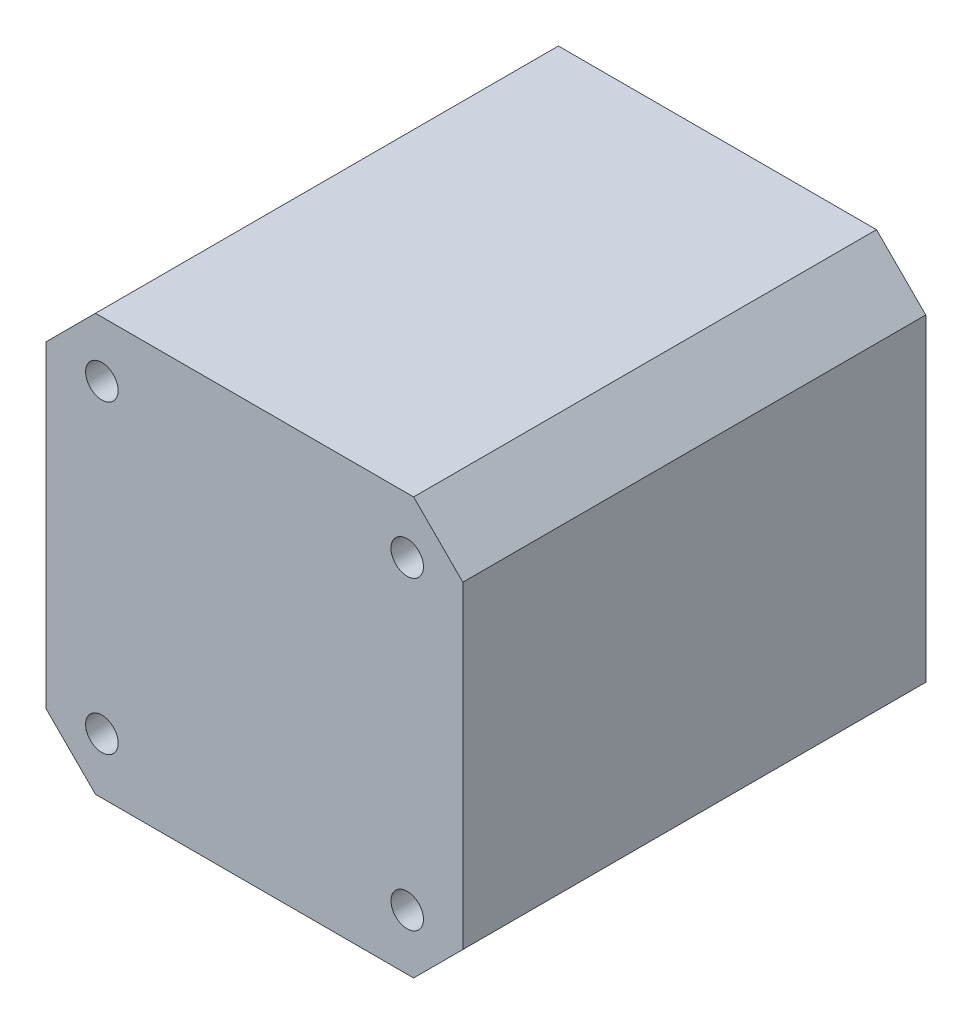
ISO-10303-21;
HEADER;
FILE_DESCRIPTION(('STEP AP214'),'2;1');
FILE_NAME('part.step','',(''),(''),'','','');
FILE_SCHEMA(('AUTOMOTIVE_DESIGN { 1 0 10303 214 1 1 1 1 }'));
ENDSEC;
DATA;
#1=APPLICATION_CONTEXT('core data for automotive mechanical design processes');
#2=APPLICATION_PROTOCOL_DEFINITION('international standard','automotive_design',2000,#1);
#3=PRODUCT_CONTEXT('',#1,'mechanical');
#4=PRODUCT('Part','Part','',(#3));
#5=PRODUCT_RELATED_PRODUCT_CATEGORY('part','',(#4));
#6=PRODUCT_DEFINITION_FORMATION('','',#4);
#7=PRODUCT_DEFINITION_CONTEXT('part definition',#1,'design');
#8=PRODUCT_DEFINITION('design','',#6,#7);
#9=PRODUCT_DEFINITION_SHAPE('','',#8);
#10=(LENGTH_UNIT() NAMED_UNIT(*) SI_UNIT(.MILLI.,.METRE.));
#11=(NAMED_UNIT(*) PLANE_ANGLE_UNIT() SI_UNIT($,.RADIAN.));
#12=(NAMED_UNIT(*) SI_UNIT($,.STERADIAN.) SOLID_ANGLE_UNIT());
#13=UNCERTAINTY_MEASURE_WITH_UNIT(LENGTH_MEASURE(1.E-05),#10,'distance_accuracy_value','');
#14=(GEOMETRIC_REPRESENTATION_CONTEXT(3) GLOBAL_UNCERTAINTY_ASSIGNED_CONTEXT((#13)) GLOBAL_UNIT_ASSIGNED_CONTEXT((#10,
#11,#12)) REPRESENTATION_CONTEXT('',''));
#15=CARTESIAN_POINT('',(0.,0.,0.));
#16=DIRECTION('',(0.,0.,1.));
#17=DIRECTION('',(1.,0.,0.));
#18=AXIS2_PLACEMENT_3D('',#15,#16,#17);
#19=CARTESIAN_POINT('',(0.,0.,-24.));
#20=DIRECTION('',(0.,0.,1.));
#21=DIRECTION('',(1.,0.,0.));
#22=AXIS2_PLACEMENT_3D('',#19,#20,#21);
#23=CYLINDRICAL_SURFACE('',#22,2.5);
#24=CARTESIAN_POINT('',(0.,0.,-14.));
#25=DIRECTION('',(0.,0.,-1.));
#26=DIRECTION('',(-1.,0.,0.));
#27=AXIS2_PLACEMENT_3D('',#24,#25,#26);
#28=CIRCLE('',#27,2.5);
#29=CARTESIAN_POINT('',(1.5,2.,-14.));
#30=VERTEX_POINT('',#29);
#31=CARTESIAN_POINT('',(-1.5,2.,-14.));
#32=VERTEX_POINT('',#31);
#33=EDGE_CURVE('E49',#30,#32,#28,.T.);
#34=ORIENTED_EDGE('',*,*,#33,.F.);
#35=DIRECTION('',(0.,0.,1.));
#36=VECTOR('',#35,1.);
#37=CARTESIAN_POINT('',(1.5,2.,-24.));
#38=LINE('',#37,#36);
#39=CARTESIAN_POINT('',(1.5,2.,-2.));
#40=VERTEX_POINT('',#39);
#41=EDGE_CURVE('E116',#30,#40,#38,.T.);
#42=ORIENTED_EDGE('',*,*,#41,.T.);
#43=CARTESIAN_POINT('',(0.,0.,-2.));
#44=DIRECTION('',(0.,0.,-1.));
#45=DIRECTION('',(-1.,0.,0.));
#46=AXIS2_PLACEMENT_3D('',#43,#44,#45);
#47=CIRCLE('',#46,2.5);
#48=CARTESIAN_POINT('',(-1.5,2.,-2.));
#49=VERTEX_POINT('',#48);
#50=EDGE_CURVE('E113',#40,#49,#47,.T.);
#51=ORIENTED_EDGE('',*,*,#50,.T.);
#52=DIRECTION('',(0.,0.,1.));
#53=VECTOR('',#52,1.);
#54=CARTESIAN_POINT('',(-1.5,2.,-24.));
#55=LINE('',#54,#53);
#56=EDGE_CURVE('E56',#32,#49,#55,.T.);
#57=ORIENTED_EDGE('',*,*,#56,.F.);
#58=EDGE_LOOP('',(#34,#42,#51,#57));
#59=FACE_BOUND('',#58,.T.);
#60=ADVANCED_FACE('F35',(#59),#23,.T.);
#61=CARTESIAN_POINT('',(1.5,2.,-24.));
#62=DIRECTION('',(0.,-1.,0.));
#63=DIRECTION('',(0.,0.,-1.));
#64=AXIS2_PLACEMENT_3D('',#61,#62,#63);
#65=PLANE('',#64);
#66=DIRECTION('',(1.,0.,0.));
#67=VECTOR('',#66,1.);
#68=CARTESIAN_POINT('',(-1.5,2.,-14.));
#69=LINE('',#68,#67);
#70=EDGE_CURVE('E110',#32,#30,#69,.T.);
#71=ORIENTED_EDGE('',*,*,#70,.F.);
#72=ORIENTED_EDGE('',*,*,#56,.T.);
#73=DIRECTION('',(1.,0.,0.));
#74=VECTOR('',#73,1.);
#75=CARTESIAN_POINT('',(1.5,2.,-2.));
#76=LINE('',#75,#74);
#77=EDGE_CURVE('E120',#49,#40,#76,.T.);
#78=ORIENTED_EDGE('',*,*,#77,.T.);
#79=ORIENTED_EDGE('',*,*,#41,.F.);
#80=EDGE_LOOP('',(#71,#72,#78,#79));
#81=FACE_BOUND('',#80,.T.);
#82=ADVANCED_FACE('F118',(#81),#65,.F.);
#83=CARTESIAN_POINT('',(0.,0.,-2.));
#84=DIRECTION('',(0.,0.,-1.));
#85=DIRECTION('',(-1.,0.,0.));
#86=AXIS2_PLACEMENT_3D('',#83,#84,#85);
#87=PLANE('',#86);
#88=CARTESIAN_POINT('',(0.,0.,-2.));
#89=DIRECTION('',(0.,0.,-1.));
#90=DIRECTION('',(-1.,0.,0.));
#91=AXIS2_PLACEMENT_3D('',#88,#89,#90);
#92=CIRCLE('',#91,11.);
#93=CARTESIAN_POINT('',(-11.,0.,-2.));
#94=VERTEX_POINT('',#93);
#95=EDGE_CURVE('E128',#94,#94,#92,.T.);
#96=ORIENTED_EDGE('',*,*,#95,.T.);
#97=EDGE_LOOP('',(#96));
#98=FACE_BOUND('',#97,.T.);
#99=ORIENTED_EDGE('',*,*,#77,.F.);
#100=ORIENTED_EDGE('',*,*,#50,.F.);
#101=EDGE_LOOP('',(#99,#100));
#102=FACE_BOUND('',#101,.T.);
#103=ADVANCED_FACE('F266',(#98,#102),#87,.T.);
#104=CARTESIAN_POINT('',(0.,0.,47.));
#105=DIRECTION('',(0.,0.,-1.));
#106=DIRECTION('',(-1.,0.,0.));
#107=AXIS2_PLACEMENT_3D('',#104,#105,#106);
#108=PLANE('',#107);
#109=DIRECTION('',(-1.,0.,0.));
#110=VECTOR('',#109,1.);
#111=CARTESIAN_POINT('',(-16.15,21.15,47.));
#112=LINE('',#111,#110);
#113=CARTESIAN_POINT('',(16.15,21.15,47.));
#114=VERTEX_POINT('',#113);
#115=CARTESIAN_POINT('',(-16.15,21.15,47.));
#116=VERTEX_POINT('',#115);
#117=EDGE_CURVE('E158',#114,#116,#112,.T.);
#118=ORIENTED_EDGE('',*,*,#117,.T.);
#119=DIRECTION('',(-0.707106781186548,-0.707106781186548,0.));
#120=VECTOR('',#119,1.);
#121=CARTESIAN_POINT('',(-21.15,16.15,47.));
#122=LINE('',#121,#120);
#123=CARTESIAN_POINT('',(-21.15,16.15,47.));
#124=VERTEX_POINT('',#123);
#125=EDGE_CURVE('E161',#116,#124,#122,.T.);
#126=ORIENTED_EDGE('',*,*,#125,.T.);
#127=DIRECTION('',(0.,-1.,0.));
#128=VECTOR('',#127,1.);
#129=CARTESIAN_POINT('',(-21.15,16.15,47.));
#130=LINE('',#129,#128);
#131=CARTESIAN_POINT('',(-21.15,-16.15,47.));
#132=VERTEX_POINT('',#131);
#133=EDGE_CURVE('E164',#124,#132,#130,.T.);
#134=ORIENTED_EDGE('',*,*,#133,.T.);
#135=DIRECTION('',(0.707106781186548,-0.707106781186548,0.));
#136=VECTOR('',#135,1.);
#137=CARTESIAN_POINT('',(-21.15,-16.15,47.));
#138=LINE('',#137,#136);
#139=CARTESIAN_POINT('',(-16.15,-21.15,47.));
#140=VERTEX_POINT('',#139);
#141=EDGE_CURVE('E166',#132,#140,#138,.T.);
#142=ORIENTED_EDGE('',*,*,#141,.T.);
#143=DIRECTION('',(1.,0.,0.));
#144=VECTOR('',#143,1.);
#145=CARTESIAN_POINT('',(-16.15,-21.15,47.));
#146=LINE('',#145,#144);
#147=CARTESIAN_POINT('',(16.15,-21.15,47.));
#148=VERTEX_POINT('',#147);
#149=EDGE_CURVE('E168',#140,#148,#146,.T.);
#150=ORIENTED_EDGE('',*,*,#149,.T.);
#151=DIRECTION('',(0.707106781186548,0.707106781186548,0.));
#152=VECTOR('',#151,1.);
#153=CARTESIAN_POINT('',(16.15,-21.15,47.));
#154=LINE('',#153,#152);
#155=CARTESIAN_POINT('',(21.15,-16.15,47.));
#156=VERTEX_POINT('',#155);
#157=EDGE_CURVE('E170',#148,#156,#154,.T.);
#158=ORIENTED_EDGE('',*,*,#157,.T.);
#159=DIRECTION('',(0.,1.,0.));
#160=VECTOR('',#159,1.);
#161=CARTESIAN_POINT('',(21.15,16.15,47.));
#162=LINE('',#161,#160);
#163=CARTESIAN_POINT('',(21.15,16.15,47.));
#164=VERTEX_POINT('',#163);
#165=EDGE_CURVE('E172',#156,#164,#162,.T.);
#166=ORIENTED_EDGE('',*,*,#165,.T.);
#167=DIRECTION('',(-0.707106781186548,0.707106781186548,0.));
#168=VECTOR('',#167,1.);
#169=CARTESIAN_POINT('',(16.15,21.15,47.));
#170=LINE('',#169,#168);
#171=EDGE_CURVE('E174',#164,#114,#170,.T.);
#172=ORIENTED_EDGE('',*,*,#171,.T.);
#173=EDGE_LOOP('',(#118,#126,#134,#142,#150,#158,#166,#172));
#174=FACE_BOUND('',#173,.T.);
#175=CARTESIAN_POINT('',(15.5,15.5,47.));
#176=DIRECTION('',(0.,0.,1.));
#177=DIRECTION('',(1.,0.,0.));
#178=AXIS2_PLACEMENT_3D('',#175,#176,#177);
#179=CIRCLE('',#178,1.65);
#180=CARTESIAN_POINT('',(17.15,15.5,47.));
#181=VERTEX_POINT('',#180);
#182=EDGE_CURVE('E152',#181,#181,#179,.T.);
#183=ORIENTED_EDGE('',*,*,#182,.F.);
#184=EDGE_LOOP('',(#183));
#185=FACE_BOUND('',#184,.T.);
#186=CARTESIAN_POINT('',(-15.5,15.5,47.));
#187=DIRECTION('',(0.,0.,1.));
#188=DIRECTION('',(-1.,0.,0.));
#189=AXIS2_PLACEMENT_3D('',#186,#187,#188);
#190=CIRCLE('',#189,1.65);
#191=CARTESIAN_POINT('',(-17.15,15.5,47.));
#192=VERTEX_POINT('',#191);
#193=EDGE_CURVE('E146',#192,#192,#190,.T.);
#194=ORIENTED_EDGE('',*,*,#193,.F.);
#195=EDGE_LOOP('',(#194));
#196=FACE_BOUND('',#195,.T.);
#197=CARTESIAN_POINT('',(15.5,-15.5,47.));
#198=DIRECTION('',(0.,0.,1.));
#199=DIRECTION('',(-1.,0.,0.));
#200=AXIS2_PLACEMENT_3D('',#197,#198,#199);
#201=CIRCLE('',#200,1.65);
#202=CARTESIAN_POINT('',(13.85,-15.5,47.));
#203=VERTEX_POINT('',#202);
#204=EDGE_CURVE('E140',#203,#203,#201,.T.);
#205=ORIENTED_EDGE('',*,*,#204,.F.);
#206=EDGE_LOOP('',(#205));
#207=FACE_BOUND('',#206,.T.);
#208=CARTESIAN_POINT('',(-15.5,-15.5,47.));
#209=DIRECTION('',(0.,0.,1.));
#210=DIRECTION('',(1.,0.,0.));
#211=AXIS2_PLACEMENT_3D('',#208,#209,#210);
#212=CIRCLE('',#211,1.65);
#213=CARTESIAN_POINT('',(-13.85,-15.5,47.));
#214=VERTEX_POINT('',#213);
#215=EDGE_CURVE('E134',#214,#214,#212,.T.);
#216=ORIENTED_EDGE('',*,*,#215,.F.);
#217=EDGE_LOOP('',(#216));
#218=FACE_BOUND('',#217,.T.);
#219=ADVANCED_FACE('F233',(#174,#185,#196,#207,#218),#108,.F.);
#220=CARTESIAN_POINT('',(0.,0.,0.));
#221=DIRECTION('',(0.,0.,-1.));
#222=DIRECTION('',(-1.,0.,0.));
#223=AXIS2_PLACEMENT_3D('',#220,#221,#222);
#224=PLANE('',#223);
#225=CARTESIAN_POINT('',(0.,0.,0.));
#226=DIRECTION('',(0.,0.,-1.));
#227=DIRECTION('',(-1.,0.,0.));
#228=AXIS2_PLACEMENT_3D('',#225,#226,#227);
#229=CIRCLE('',#228,11.);
#230=CARTESIAN_POINT('',(-11.,0.,0.));
#231=VERTEX_POINT('',#230);
#232=EDGE_CURVE('E123',#231,#231,#229,.T.);
#233=ORIENTED_EDGE('',*,*,#232,.F.);
#234=EDGE_LOOP('',(#233));
#235=FACE_BOUND('',#234,.T.);
#236=CARTESIAN_POINT('',(15.5,-15.5,0.));
#237=DIRECTION('',(0.,0.,1.));
#238=DIRECTION('',(-1.,0.,0.));
#239=AXIS2_PLACEMENT_3D('',#236,#237,#238);
#240=CIRCLE('',#239,1.65);
#241=CARTESIAN_POINT('',(13.85,-15.5,0.));
#242=VERTEX_POINT('',#241);
#243=EDGE_CURVE('E137',#242,#242,#240,.T.);
#244=ORIENTED_EDGE('',*,*,#243,.T.);
#245=EDGE_LOOP('',(#244));
#246=FACE_BOUND('',#245,.T.);
#247=CARTESIAN_POINT('',(15.5,15.5,0.));
#248=DIRECTION('',(0.,0.,1.));
#249=DIRECTION('',(1.,0.,0.));
#250=AXIS2_PLACEMENT_3D('',#247,#248,#249);
#251=CIRCLE('',#250,1.65);
#252=CARTESIAN_POINT('',(17.15,15.5,0.));
#253=VERTEX_POINT('',#252);
#254=EDGE_CURVE('E149',#253,#253,#251,.T.);
#255=ORIENTED_EDGE('',*,*,#254,.T.);
#256=EDGE_LOOP('',(#255));
#257=FACE_BOUND('',#256,.T.);
#258=DIRECTION('',(-1.,0.,0.));
#259=VECTOR('',#258,1.);
#260=CARTESIAN_POINT('',(-16.15,21.15,0.));
#261=LINE('',#260,#259);
#262=CARTESIAN_POINT('',(16.15,21.15,0.));
#263=VERTEX_POINT('',#262);
#264=CARTESIAN_POINT('',(-16.15,21.15,0.));
#265=VERTEX_POINT('',#264);
#266=EDGE_CURVE('E155',#263,#265,#261,.T.);
#267=ORIENTED_EDGE('',*,*,#266,.F.);
#268=DIRECTION('',(-0.707106781186548,0.707106781186548,0.));
#269=VECTOR('',#268,1.);
#270=CARTESIAN_POINT('',(16.15,21.15,0.));
#271=LINE('',#270,#269);
#272=CARTESIAN_POINT('',(21.15,16.15,0.));
#273=VERTEX_POINT('',#272);
#274=EDGE_CURVE('E162',#273,#263,#271,.T.);
#275=ORIENTED_EDGE('',*,*,#274,.F.);
#276=DIRECTION('',(0.,1.,0.));
#277=VECTOR('',#276,1.);
#278=CARTESIAN_POINT('',(21.15,16.15,0.));
#279=LINE('',#278,#277);
#280=CARTESIAN_POINT('',(21.15,-16.15,0.));
#281=VERTEX_POINT('',#280);
#282=EDGE_CURVE('E189',#281,#273,#279,.T.);
#283=ORIENTED_EDGE('',*,*,#282,.F.);
#284=DIRECTION('',(0.707106781186548,0.707106781186548,0.));
#285=VECTOR('',#284,1.);
#286=CARTESIAN_POINT('',(16.15,-21.15,0.));
#287=LINE('',#286,#285);
#288=CARTESIAN_POINT('',(16.15,-21.15,0.));
#289=VERTEX_POINT('',#288);
#290=EDGE_CURVE('E187',#289,#281,#287,.T.);
#291=ORIENTED_EDGE('',*,*,#290,.F.);
#292=DIRECTION('',(1.,0.,0.));
#293=VECTOR('',#292,1.);
#294=CARTESIAN_POINT('',(-16.15,-21.15,0.));
#295=LINE('',#294,#293);
#296=CARTESIAN_POINT('',(-16.15,-21.15,0.));
#297=VERTEX_POINT('',#296);
#298=EDGE_CURVE('E185',#297,#289,#295,.T.);
#299=ORIENTED_EDGE('',*,*,#298,.F.);
#300=DIRECTION('',(0.707106781186548,-0.707106781186548,0.));
#301=VECTOR('',#300,1.);
#302=CARTESIAN_POINT('',(-21.15,-16.15,0.));
#303=LINE('',#302,#301);
#304=CARTESIAN_POINT('',(-21.15,-16.15,0.));
#305=VERTEX_POINT('',#304);
#306=EDGE_CURVE('E183',#305,#297,#303,.T.);
#307=ORIENTED_EDGE('',*,*,#306,.F.);
#308=DIRECTION('',(0.,-1.,0.));
#309=VECTOR('',#308,1.);
#310=CARTESIAN_POINT('',(-21.15,16.15,0.));
#311=LINE('',#310,#309);
#312=CARTESIAN_POINT('',(-21.15,16.15,0.));
#313=VERTEX_POINT('',#312);
#314=EDGE_CURVE('E181',#313,#305,#311,.T.);
#315=ORIENTED_EDGE('',*,*,#314,.F.);
#316=DIRECTION('',(-0.707106781186548,-0.707106781186548,0.));
#317=VECTOR('',#316,1.);
#318=CARTESIAN_POINT('',(-21.15,16.15,0.));
#319=LINE('',#318,#317);
#320=EDGE_CURVE('E179',#265,#313,#319,.T.);
#321=ORIENTED_EDGE('',*,*,#320,.F.);
#322=EDGE_LOOP('',(#267,#275,#283,#291,#299,#307,#315,#321));
#323=FACE_BOUND('',#322,.T.);
#324=CARTESIAN_POINT('',(-15.5,15.5,0.));
#325=DIRECTION('',(0.,0.,1.));
#326=DIRECTION('',(-1.,0.,0.));
#327=AXIS2_PLACEMENT_3D('',#324,#325,#326);
#328=CIRCLE('',#327,1.65);
#329=CARTESIAN_POINT('',(-17.15,15.5,0.));
#330=VERTEX_POINT('',#329);
#331=EDGE_CURVE('E143',#330,#330,#328,.T.);
#332=ORIENTED_EDGE('',*,*,#331,.T.);
#333=EDGE_LOOP('',(#332));
#334=FACE_BOUND('',#333,.T.);
#335=CARTESIAN_POINT('',(-15.5,-15.5,0.));
#336=DIRECTION('',(0.,0.,1.));
#337=DIRECTION('',(1.,0.,0.));
#338=AXIS2_PLACEMENT_3D('',#335,#336,#337);
#339=CIRCLE('',#338,1.65);
#340=CARTESIAN_POINT('',(-13.85,-15.5,0.));
#341=VERTEX_POINT('',#340);
#342=EDGE_CURVE('E131',#341,#341,#339,.T.);
#343=ORIENTED_EDGE('',*,*,#342,.T.);
#344=EDGE_LOOP('',(#343));
#345=FACE_BOUND('',#344,.T.);
#346=ADVANCED_FACE('F219',(#235,#246,#257,#323,#334,#345),#224,.T.);
#347=CARTESIAN_POINT('',(-16.15,21.15,47.));
#348=DIRECTION('',(0.,-1.,0.));
#349=DIRECTION('',(0.,0.,-1.));
#350=AXIS2_PLACEMENT_3D('',#347,#348,#349);
#351=PLANE('',#350);
#352=ORIENTED_EDGE('',*,*,#266,.T.);
#353=DIRECTION('',(0.,0.,-1.));
#354=VECTOR('',#353,1.);
#355=CARTESIAN_POINT('',(-16.15,21.15,47.));
#356=LINE('',#355,#354);
#357=EDGE_CURVE('E11',#116,#265,#356,.T.);
#358=ORIENTED_EDGE('',*,*,#357,.F.);
#359=ORIENTED_EDGE('',*,*,#117,.F.);
#360=DIRECTION('',(0.,0.,-1.));
#361=VECTOR('',#360,1.);
#362=CARTESIAN_POINT('',(16.15,21.15,47.));
#363=LINE('',#362,#361);
#364=EDGE_CURVE('E176',#114,#263,#363,.T.);
#365=ORIENTED_EDGE('',*,*,#364,.T.);
#366=EDGE_LOOP('',(#352,#358,#359,#365));
#367=FACE_BOUND('',#366,.T.);
#368=ADVANCED_FACE('F37',(#367),#351,.F.);
#369=CARTESIAN_POINT('',(-21.15,16.15,47.));
#370=DIRECTION('',(0.707106781186547,-0.707106781186547,0.));
#371=DIRECTION('',(0.707106781186548,0.707106781186548,0.));
#372=AXIS2_PLACEMENT_3D('',#369,#370,#371);
#373=PLANE('',#372);
#374=ORIENTED_EDGE('',*,*,#320,.T.);
#375=DIRECTION('',(0.,0.,-1.));
#376=VECTOR('',#375,1.);
#377=CARTESIAN_POINT('',(-21.15,16.15,47.));
#378=LINE('',#377,#376);
#379=EDGE_CURVE('E43',#124,#313,#378,.T.);
#380=ORIENTED_EDGE('',*,*,#379,.F.);
#381=ORIENTED_EDGE('',*,*,#125,.F.);
#382=ORIENTED_EDGE('',*,*,#357,.T.);
#383=EDGE_LOOP('',(#374,#380,#381,#382));
#384=FACE_BOUND('',#383,.T.);
#385=ADVANCED_FACE('F238',(#384),#373,.F.);
#386=CARTESIAN_POINT('',(-21.15,16.15,47.));
#387=DIRECTION('',(1.,0.,0.));
#388=DIRECTION('',(0.,0.,-1.));
#389=AXIS2_PLACEMENT_3D('',#386,#387,#388);
#390=PLANE('',#389);
#391=ORIENTED_EDGE('',*,*,#314,.T.);
#392=DIRECTION('',(0.,0.,-1.));
#393=VECTOR('',#392,1.);
#394=CARTESIAN_POINT('',(-21.15,-16.15,47.));
#395=LINE('',#394,#393);
#396=EDGE_CURVE('E206',#132,#305,#395,.T.);
#397=ORIENTED_EDGE('',*,*,#396,.F.);
#398=ORIENTED_EDGE('',*,*,#133,.F.);
#399=ORIENTED_EDGE('',*,*,#379,.T.);
#400=EDGE_LOOP('',(#391,#397,#398,#399));
#401=FACE_BOUND('',#400,.T.);
#402=ADVANCED_FACE('F213',(#401),#390,.F.);
#403=CARTESIAN_POINT('',(-21.15,-16.15,47.));
#404=DIRECTION('',(0.707106781186547,0.707106781186547,0.));
#405=DIRECTION('',(-0.707106781186548,0.707106781186548,0.));
#406=AXIS2_PLACEMENT_3D('',#403,#404,#405);
#407=PLANE('',#406);
#408=ORIENTED_EDGE('',*,*,#306,.T.);
#409=DIRECTION('',(0.,0.,-1.));
#410=VECTOR('',#409,1.);
#411=CARTESIAN_POINT('',(-16.15,-21.15,47.));
#412=LINE('',#411,#410);
#413=EDGE_CURVE('E203',#140,#297,#412,.T.);
#414=ORIENTED_EDGE('',*,*,#413,.F.);
#415=ORIENTED_EDGE('',*,*,#141,.F.);
#416=ORIENTED_EDGE('',*,*,#396,.T.);
#417=EDGE_LOOP('',(#408,#414,#415,#416));
#418=FACE_BOUND('',#417,.T.);
#419=ADVANCED_FACE('F225',(#418),#407,.F.);
#420=CARTESIAN_POINT('',(-16.15,-21.15,47.));
#421=DIRECTION('',(0.,1.,0.));
#422=DIRECTION('',(0.,0.,1.));
#423=AXIS2_PLACEMENT_3D('',#420,#421,#422);
#424=PLANE('',#423);
#425=ORIENTED_EDGE('',*,*,#298,.T.);
#426=DIRECTION('',(0.,0.,-1.));
#427=VECTOR('',#426,1.);
#428=CARTESIAN_POINT('',(16.15,-21.15,47.));
#429=LINE('',#428,#427);
#430=EDGE_CURVE('E200',#148,#289,#429,.T.);
#431=ORIENTED_EDGE('',*,*,#430,.F.);
#432=ORIENTED_EDGE('',*,*,#149,.F.);
#433=ORIENTED_EDGE('',*,*,#413,.T.);
#434=EDGE_LOOP('',(#425,#431,#432,#433));
#435=FACE_BOUND('',#434,.T.);
#436=ADVANCED_FACE('F229',(#435),#424,.F.);
#437=CARTESIAN_POINT('',(16.15,-21.15,47.));
#438=DIRECTION('',(-0.707106781186547,0.707106781186547,0.));
#439=DIRECTION('',(-0.707106781186548,-0.707106781186548,0.));
#440=AXIS2_PLACEMENT_3D('',#437,#438,#439);
#441=PLANE('',#440);
#442=ORIENTED_EDGE('',*,*,#290,.T.);
#443=DIRECTION('',(0.,0.,-1.));
#444=VECTOR('',#443,1.);
#445=CARTESIAN_POINT('',(21.15,-16.15,47.));
#446=LINE('',#445,#444);
#447=EDGE_CURVE('E197',#156,#281,#446,.T.);
#448=ORIENTED_EDGE('',*,*,#447,.F.);
#449=ORIENTED_EDGE('',*,*,#157,.F.);
#450=ORIENTED_EDGE('',*,*,#430,.T.);
#451=EDGE_LOOP('',(#442,#448,#449,#450));
#452=FACE_BOUND('',#451,.T.);
#453=ADVANCED_FACE('F251',(#452),#441,.F.);
#454=CARTESIAN_POINT('',(21.15,16.15,47.));
#455=DIRECTION('',(-1.,0.,0.));
#456=DIRECTION('',(0.,-1.,0.));
#457=AXIS2_PLACEMENT_3D('',#454,#455,#456);
#458=PLANE('',#457);
#459=ORIENTED_EDGE('',*,*,#282,.T.);
#460=DIRECTION('',(0.,0.,-1.));
#461=VECTOR('',#460,1.);
#462=CARTESIAN_POINT('',(21.15,16.15,47.));
#463=LINE('',#462,#461);
#464=EDGE_CURVE('E194',#164,#273,#463,.T.);
#465=ORIENTED_EDGE('',*,*,#464,.F.);
#466=ORIENTED_EDGE('',*,*,#165,.F.);
#467=ORIENTED_EDGE('',*,*,#447,.T.);
#468=EDGE_LOOP('',(#459,#465,#466,#467));
#469=FACE_BOUND('',#468,.T.);
#470=ADVANCED_FACE('F249',(#469),#458,.F.);
#471=CARTESIAN_POINT('',(16.15,21.15,47.));
#472=DIRECTION('',(-0.707106781186547,-0.707106781186547,0.));
#473=DIRECTION('',(0.707106781186548,-0.707106781186548,0.));
#474=AXIS2_PLACEMENT_3D('',#471,#472,#473);
#475=PLANE('',#474);
#476=ORIENTED_EDGE('',*,*,#274,.T.);
#477=ORIENTED_EDGE('',*,*,#364,.F.);
#478=ORIENTED_EDGE('',*,*,#171,.F.);
#479=ORIENTED_EDGE('',*,*,#464,.T.);
#480=EDGE_LOOP('',(#476,#477,#478,#479));
#481=FACE_BOUND('',#480,.T.);
#482=ADVANCED_FACE('F244',(#481),#475,.F.);
#483=CARTESIAN_POINT('',(15.5,15.5,47.));
#484=DIRECTION('',(0.,0.,-1.));
#485=DIRECTION('',(-1.,0.,0.));
#486=AXIS2_PLACEMENT_3D('',#483,#484,#485);
#487=CYLINDRICAL_SURFACE('',#486,1.65);
#488=ORIENTED_EDGE('',*,*,#182,.T.);
#489=EDGE_LOOP('',(#488));
#490=FACE_BOUND('',#489,.T.);
#491=ORIENTED_EDGE('',*,*,#254,.F.);
#492=EDGE_LOOP('',(#491));
#493=FACE_BOUND('',#492,.T.);
#494=ADVANCED_FACE('F288',(#490,#493),#487,.F.);
#495=CARTESIAN_POINT('',(-15.5,15.5,47.));
#496=DIRECTION('',(0.,0.,-1.));
#497=DIRECTION('',(-1.,0.,0.));
#498=AXIS2_PLACEMENT_3D('',#495,#496,#497);
#499=CYLINDRICAL_SURFACE('',#498,1.65);
#500=ORIENTED_EDGE('',*,*,#193,.T.);
#501=EDGE_LOOP('',(#500));
#502=FACE_BOUND('',#501,.T.);
#503=ORIENTED_EDGE('',*,*,#331,.F.);
#504=EDGE_LOOP('',(#503));
#505=FACE_BOUND('',#504,.T.);
#506=ADVANCED_FACE('F284',(#502,#505),#499,.F.);
#507=CARTESIAN_POINT('',(15.5,-15.5,47.));
#508=DIRECTION('',(0.,0.,-1.));
#509=DIRECTION('',(-1.,0.,0.));
#510=AXIS2_PLACEMENT_3D('',#507,#508,#509);
#511=CYLINDRICAL_SURFACE('',#510,1.65);
#512=ORIENTED_EDGE('',*,*,#204,.T.);
#513=EDGE_LOOP('',(#512));
#514=FACE_BOUND('',#513,.T.);
#515=ORIENTED_EDGE('',*,*,#243,.F.);
#516=EDGE_LOOP('',(#515));
#517=FACE_BOUND('',#516,.T.);
#518=ADVANCED_FACE('F280',(#514,#517),#511,.F.);
#519=CARTESIAN_POINT('',(-15.5,-15.5,47.));
#520=DIRECTION('',(0.,0.,-1.));
#521=DIRECTION('',(-1.,0.,0.));
#522=AXIS2_PLACEMENT_3D('',#519,#520,#521);
#523=CYLINDRICAL_SURFACE('',#522,1.65);
#524=ORIENTED_EDGE('',*,*,#215,.T.);
#525=EDGE_LOOP('',(#524));
#526=FACE_BOUND('',#525,.T.);
#527=ORIENTED_EDGE('',*,*,#342,.F.);
#528=EDGE_LOOP('',(#527));
#529=FACE_BOUND('',#528,.T.);
#530=ADVANCED_FACE('F276',(#526,#529),#523,.F.);
#531=CARTESIAN_POINT('',(0.,0.,-2.));
#532=DIRECTION('',(0.,0.,1.));
#533=DIRECTION('',(1.,0.,0.));
#534=AXIS2_PLACEMENT_3D('',#531,#532,#533);
#535=CYLINDRICAL_SURFACE('',#534,11.);
#536=ORIENTED_EDGE('',*,*,#95,.F.);
#537=EDGE_LOOP('',(#536));
#538=FACE_BOUND('',#537,.T.);
#539=ORIENTED_EDGE('',*,*,#232,.T.);
#540=EDGE_LOOP('',(#539));
#541=FACE_BOUND('',#540,.T.);
#542=ADVANCED_FACE('F273',(#538,#541),#535,.T.);
#543=CARTESIAN_POINT('',(0.,0.,-14.));
#544=DIRECTION('',(0.,0.,-1.));
#545=DIRECTION('',(-1.,0.,0.));
#546=AXIS2_PLACEMENT_3D('',#543,#544,#545);
#547=PLANE('',#546);
#548=ORIENTED_EDGE('',*,*,#33,.T.);
#549=ORIENTED_EDGE('',*,*,#70,.T.);
#550=EDGE_LOOP('',(#548,#549));
#551=FACE_BOUND('',#550,.T.);
#552=ADVANCED_FACE('F111',(#551),#547,.T.);
#553=CLOSED_SHELL('',(#60,#82,#103,#219,#346,#368,#385,#402,#419,#436,#453,#470,#482,#494,#506,
#518,#530,#542,#552));
#554=MANIFOLD_SOLID_BREP('B2',#553);
#555=ADVANCED_BREP_SHAPE_REPRESENTATION('',(#18,#554),#14);
#556=SHAPE_DEFINITION_REPRESENTATION(#9,#555);
ENDSEC;
END-ISO-10303-21;
